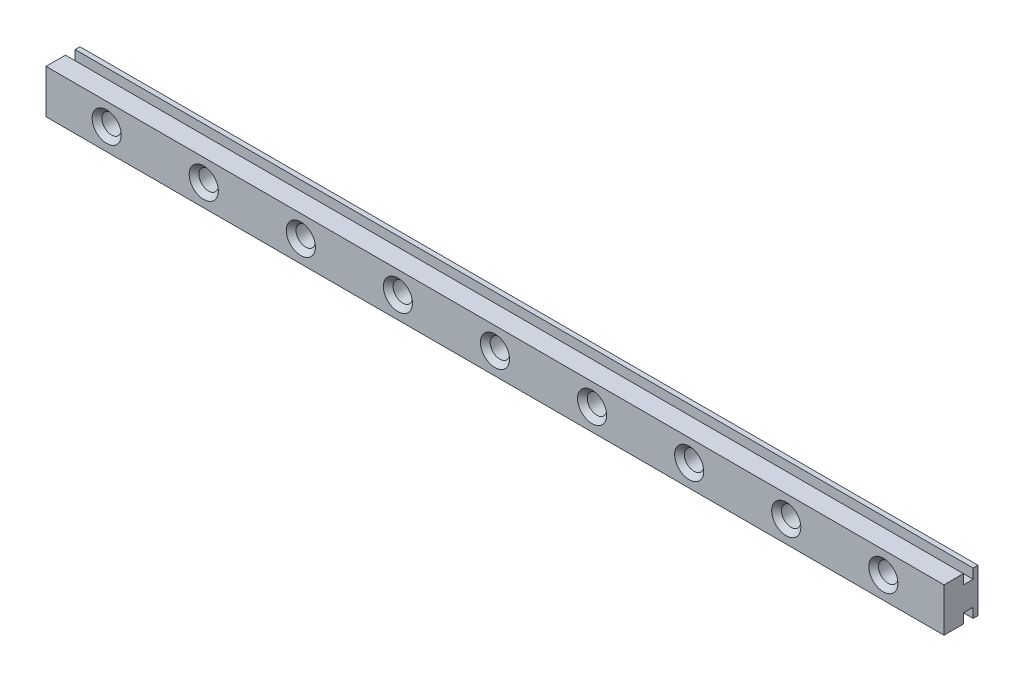
ISO-10303-21;
HEADER;
FILE_DESCRIPTION(('STEP AP214'),'2;1');
FILE_NAME('part.step','',(''),(''),'','','');
FILE_SCHEMA(('AUTOMOTIVE_DESIGN { 1 0 10303 214 1 1 1 1 }'));
ENDSEC;
DATA;
#1=APPLICATION_CONTEXT('core data for automotive mechanical design processes');
#2=APPLICATION_PROTOCOL_DEFINITION('international standard','automotive_design',2000,#1);
#3=PRODUCT_CONTEXT('',#1,'mechanical');
#4=PRODUCT('Part','Part','',(#3));
#5=PRODUCT_RELATED_PRODUCT_CATEGORY('part','',(#4));
#6=PRODUCT_DEFINITION_FORMATION('','',#4);
#7=PRODUCT_DEFINITION_CONTEXT('part definition',#1,'design');
#8=PRODUCT_DEFINITION('design','',#6,#7);
#9=PRODUCT_DEFINITION_SHAPE('','',#8);
#10=(LENGTH_UNIT() NAMED_UNIT(*) SI_UNIT(.MILLI.,.METRE.));
#11=(NAMED_UNIT(*) PLANE_ANGLE_UNIT() SI_UNIT($,.RADIAN.));
#12=(NAMED_UNIT(*) SI_UNIT($,.STERADIAN.) SOLID_ANGLE_UNIT());
#13=UNCERTAINTY_MEASURE_WITH_UNIT(LENGTH_MEASURE(1.E-05),#10,'distance_accuracy_value','');
#14=(GEOMETRIC_REPRESENTATION_CONTEXT(3) GLOBAL_UNCERTAINTY_ASSIGNED_CONTEXT((#13)) GLOBAL_UNIT_ASSIGNED_CONTEXT((#10,
#11,#12)) REPRESENTATION_CONTEXT('',''));
#15=CARTESIAN_POINT('',(0.,0.,0.));
#16=DIRECTION('',(0.,0.,1.));
#17=DIRECTION('',(1.,0.,0.));
#18=AXIS2_PLACEMENT_3D('',#15,#16,#17);
#19=CARTESIAN_POINT('',(92.5,-4.5,7.));
#20=DIRECTION('',(0.,1.,0.));
#21=DIRECTION('',(0.,0.,1.));
#22=AXIS2_PLACEMENT_3D('',#19,#20,#21);
#23=PLANE('',#22);
#24=DIRECTION('',(0.,0.,-1.));
#25=VECTOR('',#24,1.);
#26=CARTESIAN_POINT('',(-92.5,-4.5,7.));
#27=LINE('',#26,#25);
#28=CARTESIAN_POINT('',(-92.5,-4.5,7.));
#29=VERTEX_POINT('',#28);
#30=CARTESIAN_POINT('',(-92.5,-4.5,3.));
#31=VERTEX_POINT('',#30);
#32=EDGE_CURVE('E247',#29,#31,#27,.T.);
#33=ORIENTED_EDGE('',*,*,#32,.T.);
#34=DIRECTION('',(-1.,0.,0.));
#35=VECTOR('',#34,1.);
#36=CARTESIAN_POINT('',(92.501,-4.5,3.));
#37=LINE('',#36,#35);
#38=CARTESIAN_POINT('',(92.5,-4.5,3.));
#39=VERTEX_POINT('',#38);
#40=EDGE_CURVE('E175',#39,#31,#37,.T.);
#41=ORIENTED_EDGE('',*,*,#40,.F.);
#42=DIRECTION('',(0.,0.,-1.));
#43=VECTOR('',#42,1.);
#44=CARTESIAN_POINT('',(92.5,-4.5,7.));
#45=LINE('',#44,#43);
#46=CARTESIAN_POINT('',(92.5,-4.5,7.));
#47=VERTEX_POINT('',#46);
#48=EDGE_CURVE('E243',#47,#39,#45,.T.);
#49=ORIENTED_EDGE('',*,*,#48,.F.);
#50=DIRECTION('',(1.,0.,0.));
#51=VECTOR('',#50,1.);
#52=CARTESIAN_POINT('',(92.5,-4.5,7.));
#53=LINE('',#52,#51);
#54=EDGE_CURVE('E219',#29,#47,#53,.T.);
#55=ORIENTED_EDGE('',*,*,#54,.F.);
#56=EDGE_LOOP('',(#33,#41,#49,#55));
#57=FACE_BOUND('',#56,.T.);
#58=ADVANCED_FACE('F39',(#57),#23,.F.);
#59=CARTESIAN_POINT('',(92.5,4.5,7.));
#60=DIRECTION('',(0.,-1.,0.));
#61=DIRECTION('',(0.,0.,-1.));
#62=AXIS2_PLACEMENT_3D('',#59,#60,#61);
#63=PLANE('',#62);
#64=DIRECTION('',(0.,0.,-1.));
#65=VECTOR('',#64,1.);
#66=CARTESIAN_POINT('',(-92.5,4.5,7.));
#67=LINE('',#66,#65);
#68=CARTESIAN_POINT('',(-92.5,4.5,1.));
#69=VERTEX_POINT('',#68);
#70=CARTESIAN_POINT('',(-92.5,4.5,0.));
#71=VERTEX_POINT('',#70);
#72=EDGE_CURVE('E226',#69,#71,#67,.T.);
#73=ORIENTED_EDGE('',*,*,#72,.F.);
#74=DIRECTION('',(-1.,0.,0.));
#75=VECTOR('',#74,1.);
#76=CARTESIAN_POINT('',(92.501,4.5,1.));
#77=LINE('',#76,#75);
#78=CARTESIAN_POINT('',(92.5,4.5,1.));
#79=VERTEX_POINT('',#78);
#80=EDGE_CURVE('E149',#79,#69,#77,.T.);
#81=ORIENTED_EDGE('',*,*,#80,.F.);
#82=DIRECTION('',(0.,0.,-1.));
#83=VECTOR('',#82,1.);
#84=CARTESIAN_POINT('',(92.5,4.5,7.));
#85=LINE('',#84,#83);
#86=CARTESIAN_POINT('',(92.5,4.5,0.));
#87=VERTEX_POINT('',#86);
#88=EDGE_CURVE('E154',#79,#87,#85,.T.);
#89=ORIENTED_EDGE('',*,*,#88,.T.);
#90=DIRECTION('',(-1.,0.,0.));
#91=VECTOR('',#90,1.);
#92=CARTESIAN_POINT('',(92.5,4.5,0.));
#93=LINE('',#92,#91);
#94=EDGE_CURVE('E220',#87,#71,#93,.T.);
#95=ORIENTED_EDGE('',*,*,#94,.T.);
#96=EDGE_LOOP('',(#73,#81,#89,#95));
#97=FACE_BOUND('',#96,.T.);
#98=ADVANCED_FACE('F318',(#97),#63,.F.);
#99=CARTESIAN_POINT('',(0.,0.,7.));
#100=DIRECTION('',(0.,0.,1.));
#101=DIRECTION('',(1.,0.,0.));
#102=AXIS2_PLACEMENT_3D('',#99,#100,#101);
#103=PLANE('',#102);
#104=CARTESIAN_POINT('',(79.9999999999999,0.,7.));
#105=DIRECTION('',(0.,0.,1.));
#106=DIRECTION('',(1.,0.,0.));
#107=AXIS2_PLACEMENT_3D('',#104,#105,#106);
#108=CIRCLE('',#107,2.99999999999995);
#109=CARTESIAN_POINT('',(82.9999999999999,0.,7.));
#110=VERTEX_POINT('',#109);
#111=EDGE_CURVE('E277',#110,#110,#108,.F.);
#112=ORIENTED_EDGE('',*,*,#111,.T.);
#113=EDGE_LOOP('',(#112));
#114=FACE_BOUND('',#113,.T.);
#115=CARTESIAN_POINT('',(59.9999999999999,0.,7.));
#116=DIRECTION('',(0.,0.,1.));
#117=DIRECTION('',(1.,0.,0.));
#118=AXIS2_PLACEMENT_3D('',#115,#116,#117);
#119=CIRCLE('',#118,2.99999999999995);
#120=CARTESIAN_POINT('',(62.9999999999999,0.,7.));
#121=VERTEX_POINT('',#120);
#122=EDGE_CURVE('E274',#121,#121,#119,.F.);
#123=ORIENTED_EDGE('',*,*,#122,.T.);
#124=EDGE_LOOP('',(#123));
#125=FACE_BOUND('',#124,.T.);
#126=CARTESIAN_POINT('',(39.9999999999999,0.,7.));
#127=DIRECTION('',(0.,0.,1.));
#128=DIRECTION('',(1.,0.,0.));
#129=AXIS2_PLACEMENT_3D('',#126,#127,#128);
#130=CIRCLE('',#129,2.99999999999995);
#131=CARTESIAN_POINT('',(42.9999999999999,0.,7.));
#132=VERTEX_POINT('',#131);
#133=EDGE_CURVE('E271',#132,#132,#130,.F.);
#134=ORIENTED_EDGE('',*,*,#133,.T.);
#135=EDGE_LOOP('',(#134));
#136=FACE_BOUND('',#135,.T.);
#137=CARTESIAN_POINT('',(19.9999999999999,0.,7.));
#138=DIRECTION('',(0.,0.,1.));
#139=DIRECTION('',(1.,0.,0.));
#140=AXIS2_PLACEMENT_3D('',#137,#138,#139);
#141=CIRCLE('',#140,2.99999999999995);
#142=CARTESIAN_POINT('',(22.9999999999999,0.,7.));
#143=VERTEX_POINT('',#142);
#144=EDGE_CURVE('E268',#143,#143,#141,.F.);
#145=ORIENTED_EDGE('',*,*,#144,.T.);
#146=EDGE_LOOP('',(#145));
#147=FACE_BOUND('',#146,.T.);
#148=CARTESIAN_POINT('',(0.,0.,7.));
#149=DIRECTION('',(0.,0.,1.));
#150=DIRECTION('',(1.,0.,0.));
#151=AXIS2_PLACEMENT_3D('',#148,#149,#150);
#152=CIRCLE('',#151,3.00000000000003);
#153=CARTESIAN_POINT('',(2.99999999999995,0.,7.));
#154=VERTEX_POINT('',#153);
#155=EDGE_CURVE('E265',#154,#154,#152,.F.);
#156=ORIENTED_EDGE('',*,*,#155,.T.);
#157=EDGE_LOOP('',(#156));
#158=FACE_BOUND('',#157,.T.);
#159=CARTESIAN_POINT('',(-20.0000000000001,0.,7.));
#160=DIRECTION('',(0.,0.,1.));
#161=DIRECTION('',(1.,0.,0.));
#162=AXIS2_PLACEMENT_3D('',#159,#160,#161);
#163=CIRCLE('',#162,2.99999999999995);
#164=CARTESIAN_POINT('',(-17.0000000000001,0.,7.));
#165=VERTEX_POINT('',#164);
#166=EDGE_CURVE('E262',#165,#165,#163,.F.);
#167=ORIENTED_EDGE('',*,*,#166,.T.);
#168=EDGE_LOOP('',(#167));
#169=FACE_BOUND('',#168,.T.);
#170=CARTESIAN_POINT('',(-40.0000000000001,0.,7.));
#171=DIRECTION('',(0.,0.,1.));
#172=DIRECTION('',(1.,0.,0.));
#173=AXIS2_PLACEMENT_3D('',#170,#171,#172);
#174=CIRCLE('',#173,2.99999999999995);
#175=CARTESIAN_POINT('',(-37.0000000000001,0.,7.));
#176=VERTEX_POINT('',#175);
#177=EDGE_CURVE('E259',#176,#176,#174,.F.);
#178=ORIENTED_EDGE('',*,*,#177,.T.);
#179=EDGE_LOOP('',(#178));
#180=FACE_BOUND('',#179,.T.);
#181=CARTESIAN_POINT('',(-60.0000000000001,0.,7.));
#182=DIRECTION('',(0.,0.,1.));
#183=DIRECTION('',(1.,0.,0.));
#184=AXIS2_PLACEMENT_3D('',#181,#182,#183);
#185=CIRCLE('',#184,3.00000000000003);
#186=CARTESIAN_POINT('',(-57.,0.,7.));
#187=VERTEX_POINT('',#186);
#188=EDGE_CURVE('E256',#187,#187,#185,.F.);
#189=ORIENTED_EDGE('',*,*,#188,.T.);
#190=EDGE_LOOP('',(#189));
#191=FACE_BOUND('',#190,.T.);
#192=CARTESIAN_POINT('',(-80.0000000000001,0.,7.));
#193=DIRECTION('',(0.,0.,1.));
#194=DIRECTION('',(1.,0.,0.));
#195=AXIS2_PLACEMENT_3D('',#192,#193,#194);
#196=CIRCLE('',#195,3.00000000000003);
#197=CARTESIAN_POINT('',(-77.0000000000001,0.,7.));
#198=VERTEX_POINT('',#197);
#199=EDGE_CURVE('E253',#198,#198,#196,.F.);
#200=ORIENTED_EDGE('',*,*,#199,.T.);
#201=EDGE_LOOP('',(#200));
#202=FACE_BOUND('',#201,.T.);
#203=DIRECTION('',(0.,-1.,0.));
#204=VECTOR('',#203,1.);
#205=CARTESIAN_POINT('',(-92.5,-4.5,7.));
#206=LINE('',#205,#204);
#207=CARTESIAN_POINT('',(-92.5,4.5,7.));
#208=VERTEX_POINT('',#207);
#209=EDGE_CURVE('E216',#208,#29,#206,.T.);
#210=ORIENTED_EDGE('',*,*,#209,.T.);
#211=ORIENTED_EDGE('',*,*,#54,.T.);
#212=DIRECTION('',(0.,1.,0.));
#213=VECTOR('',#212,1.);
#214=CARTESIAN_POINT('',(92.5,-4.5,7.));
#215=LINE('',#214,#213);
#216=CARTESIAN_POINT('',(92.5,4.5,7.));
#217=VERTEX_POINT('',#216);
#218=EDGE_CURVE('E222',#47,#217,#215,.T.);
#219=ORIENTED_EDGE('',*,*,#218,.T.);
#220=DIRECTION('',(-1.,0.,0.));
#221=VECTOR('',#220,1.);
#222=CARTESIAN_POINT('',(92.5,4.5,7.));
#223=LINE('',#222,#221);
#224=EDGE_CURVE('E224',#217,#208,#223,.T.);
#225=ORIENTED_EDGE('',*,*,#224,.T.);
#226=EDGE_LOOP('',(#210,#211,#219,#225));
#227=FACE_BOUND('',#226,.T.);
#228=ADVANCED_FACE('F325',(#114,#125,#136,#147,#158,#169,#180,#191,#202,#227),#103,.T.);
#229=CARTESIAN_POINT('',(0.,0.,0.));
#230=DIRECTION('',(0.,0.,1.));
#231=DIRECTION('',(1.,0.,0.));
#232=AXIS2_PLACEMENT_3D('',#229,#230,#231);
#233=PLANE('',#232);
#234=DIRECTION('',(0.,-1.,0.));
#235=VECTOR('',#234,1.);
#236=CARTESIAN_POINT('',(-92.5,-4.5,0.));
#237=LINE('',#236,#235);
#238=CARTESIAN_POINT('',(-92.5,-4.5,0.));
#239=VERTEX_POINT('',#238);
#240=EDGE_CURVE('E215',#71,#239,#237,.T.);
#241=ORIENTED_EDGE('',*,*,#240,.F.);
#242=ORIENTED_EDGE('',*,*,#94,.F.);
#243=DIRECTION('',(0.,1.,0.));
#244=VECTOR('',#243,1.);
#245=CARTESIAN_POINT('',(92.5,-4.5,0.));
#246=LINE('',#245,#244);
#247=CARTESIAN_POINT('',(92.5,-4.5,0.));
#248=VERTEX_POINT('',#247);
#249=EDGE_CURVE('E232',#248,#87,#246,.T.);
#250=ORIENTED_EDGE('',*,*,#249,.F.);
#251=DIRECTION('',(1.,0.,0.));
#252=VECTOR('',#251,1.);
#253=CARTESIAN_POINT('',(92.5,-4.5,0.));
#254=LINE('',#253,#252);
#255=EDGE_CURVE('E229',#239,#248,#254,.T.);
#256=ORIENTED_EDGE('',*,*,#255,.F.);
#257=EDGE_LOOP('',(#241,#242,#250,#256));
#258=FACE_BOUND('',#257,.T.);
#259=CARTESIAN_POINT('',(-80.0000000000001,0.,0.));
#260=DIRECTION('',(0.,0.,1.));
#261=DIRECTION('',(1.,0.,0.));
#262=AXIS2_PLACEMENT_3D('',#259,#260,#261);
#263=CIRCLE('',#262,2.);
#264=CARTESIAN_POINT('',(-78.0000000000001,0.,0.));
#265=VERTEX_POINT('',#264);
#266=EDGE_CURVE('E212',#265,#265,#263,.T.);
#267=ORIENTED_EDGE('',*,*,#266,.T.);
#268=EDGE_LOOP('',(#267));
#269=FACE_BOUND('',#268,.T.);
#270=CARTESIAN_POINT('',(-60.0000000000001,0.,0.));
#271=DIRECTION('',(0.,0.,1.));
#272=DIRECTION('',(1.,0.,0.));
#273=AXIS2_PLACEMENT_3D('',#270,#271,#272);
#274=CIRCLE('',#273,2.);
#275=CARTESIAN_POINT('',(-58.0000000000001,0.,0.));
#276=VERTEX_POINT('',#275);
#277=EDGE_CURVE('E209',#276,#276,#274,.T.);
#278=ORIENTED_EDGE('',*,*,#277,.T.);
#279=EDGE_LOOP('',(#278));
#280=FACE_BOUND('',#279,.T.);
#281=CARTESIAN_POINT('',(-40.0000000000001,0.,0.));
#282=DIRECTION('',(0.,0.,1.));
#283=DIRECTION('',(1.,0.,0.));
#284=AXIS2_PLACEMENT_3D('',#281,#282,#283);
#285=CIRCLE('',#284,2.);
#286=CARTESIAN_POINT('',(-38.0000000000001,0.,0.));
#287=VERTEX_POINT('',#286);
#288=EDGE_CURVE('E206',#287,#287,#285,.T.);
#289=ORIENTED_EDGE('',*,*,#288,.T.);
#290=EDGE_LOOP('',(#289));
#291=FACE_BOUND('',#290,.T.);
#292=CARTESIAN_POINT('',(-20.0000000000001,0.,0.));
#293=DIRECTION('',(0.,0.,1.));
#294=DIRECTION('',(1.,0.,0.));
#295=AXIS2_PLACEMENT_3D('',#292,#293,#294);
#296=CIRCLE('',#295,2.);
#297=CARTESIAN_POINT('',(-18.0000000000001,0.,0.));
#298=VERTEX_POINT('',#297);
#299=EDGE_CURVE('E203',#298,#298,#296,.T.);
#300=ORIENTED_EDGE('',*,*,#299,.T.);
#301=EDGE_LOOP('',(#300));
#302=FACE_BOUND('',#301,.T.);
#303=CARTESIAN_POINT('',(0.,0.,0.));
#304=DIRECTION('',(0.,0.,1.));
#305=DIRECTION('',(1.,0.,0.));
#306=AXIS2_PLACEMENT_3D('',#303,#304,#305);
#307=CIRCLE('',#306,2.);
#308=CARTESIAN_POINT('',(1.99999999999991,0.,0.));
#309=VERTEX_POINT('',#308);
#310=EDGE_CURVE('E200',#309,#309,#307,.T.);
#311=ORIENTED_EDGE('',*,*,#310,.T.);
#312=EDGE_LOOP('',(#311));
#313=FACE_BOUND('',#312,.T.);
#314=CARTESIAN_POINT('',(19.9999999999999,0.,0.));
#315=DIRECTION('',(0.,0.,1.));
#316=DIRECTION('',(1.,0.,0.));
#317=AXIS2_PLACEMENT_3D('',#314,#315,#316);
#318=CIRCLE('',#317,2.);
#319=CARTESIAN_POINT('',(21.9999999999999,0.,0.));
#320=VERTEX_POINT('',#319);
#321=EDGE_CURVE('E197',#320,#320,#318,.T.);
#322=ORIENTED_EDGE('',*,*,#321,.T.);
#323=EDGE_LOOP('',(#322));
#324=FACE_BOUND('',#323,.T.);
#325=CARTESIAN_POINT('',(39.9999999999999,0.,0.));
#326=DIRECTION('',(0.,0.,1.));
#327=DIRECTION('',(1.,0.,0.));
#328=AXIS2_PLACEMENT_3D('',#325,#326,#327);
#329=CIRCLE('',#328,2.);
#330=CARTESIAN_POINT('',(41.9999999999999,0.,0.));
#331=VERTEX_POINT('',#330);
#332=EDGE_CURVE('E194',#331,#331,#329,.T.);
#333=ORIENTED_EDGE('',*,*,#332,.T.);
#334=EDGE_LOOP('',(#333));
#335=FACE_BOUND('',#334,.T.);
#336=CARTESIAN_POINT('',(59.9999999999999,0.,0.));
#337=DIRECTION('',(0.,0.,1.));
#338=DIRECTION('',(1.,0.,0.));
#339=AXIS2_PLACEMENT_3D('',#336,#337,#338);
#340=CIRCLE('',#339,2.);
#341=CARTESIAN_POINT('',(61.9999999999999,0.,0.));
#342=VERTEX_POINT('',#341);
#343=EDGE_CURVE('E191',#342,#342,#340,.T.);
#344=ORIENTED_EDGE('',*,*,#343,.T.);
#345=EDGE_LOOP('',(#344));
#346=FACE_BOUND('',#345,.T.);
#347=CARTESIAN_POINT('',(79.9999999999999,0.,0.));
#348=DIRECTION('',(0.,0.,1.));
#349=DIRECTION('',(1.,0.,0.));
#350=AXIS2_PLACEMENT_3D('',#347,#348,#349);
#351=CIRCLE('',#350,1.99999999999998);
#352=CARTESIAN_POINT('',(81.9999999999999,0.,0.));
#353=VERTEX_POINT('',#352);
#354=EDGE_CURVE('E148',#353,#353,#351,.T.);
#355=ORIENTED_EDGE('',*,*,#354,.T.);
#356=EDGE_LOOP('',(#355));
#357=FACE_BOUND('',#356,.T.);
#358=ADVANCED_FACE('F338',(#258,#269,#280,#291,#302,#313,#324,#335,#346,#357),#233,.F.);
#359=CARTESIAN_POINT('',(-92.5,-4.5,7.));
#360=DIRECTION('',(1.,0.,0.));
#361=DIRECTION('',(0.,0.,-1.));
#362=AXIS2_PLACEMENT_3D('',#359,#360,#361);
#363=PLANE('',#362);
#364=DIRECTION('',(0.,0.,1.));
#365=VECTOR('',#364,1.);
#366=CARTESIAN_POINT('',(-92.5,2.49999999999998,3.));
#367=LINE('',#366,#365);
#368=CARTESIAN_POINT('',(-92.5,2.49999999999998,1.));
#369=VERTEX_POINT('',#368);
#370=CARTESIAN_POINT('',(-92.5,2.49999999999998,3.));
#371=VERTEX_POINT('',#370);
#372=EDGE_CURVE('E157',#369,#371,#367,.T.);
#373=ORIENTED_EDGE('',*,*,#372,.F.);
#374=DIRECTION('',(0.,-1.,0.));
#375=VECTOR('',#374,1.);
#376=CARTESIAN_POINT('',(-92.5,2.49999999999998,1.));
#377=LINE('',#376,#375);
#378=EDGE_CURVE('E136',#69,#369,#377,.T.);
#379=ORIENTED_EDGE('',*,*,#378,.F.);
#380=ORIENTED_EDGE('',*,*,#72,.T.);
#381=ORIENTED_EDGE('',*,*,#240,.T.);
#382=CARTESIAN_POINT('',(-92.5,-4.5,1.));
#383=VERTEX_POINT('',#382);
#384=EDGE_CURVE('E246',#383,#239,#27,.T.);
#385=ORIENTED_EDGE('',*,*,#384,.F.);
#386=DIRECTION('',(0.,-1.,0.));
#387=VECTOR('',#386,1.);
#388=CARTESIAN_POINT('',(-92.5,-2.49999999999998,1.));
#389=LINE('',#388,#387);
#390=CARTESIAN_POINT('',(-92.5,-2.49999999999998,1.));
#391=VERTEX_POINT('',#390);
#392=EDGE_CURVE('E180',#391,#383,#389,.T.);
#393=ORIENTED_EDGE('',*,*,#392,.F.);
#394=DIRECTION('',(0.,0.,-1.));
#395=VECTOR('',#394,1.);
#396=CARTESIAN_POINT('',(-92.5,-2.49999999999998,3.));
#397=LINE('',#396,#395);
#398=CARTESIAN_POINT('',(-92.5,-2.49999999999998,3.));
#399=VERTEX_POINT('',#398);
#400=EDGE_CURVE('E182',#399,#391,#397,.T.);
#401=ORIENTED_EDGE('',*,*,#400,.F.);
#402=DIRECTION('',(0.,1.,0.));
#403=VECTOR('',#402,1.);
#404=CARTESIAN_POINT('',(-92.5,-2.49999999999998,3.));
#405=LINE('',#404,#403);
#406=EDGE_CURVE('E173',#31,#399,#405,.T.);
#407=ORIENTED_EDGE('',*,*,#406,.F.);
#408=ORIENTED_EDGE('',*,*,#32,.F.);
#409=ORIENTED_EDGE('',*,*,#209,.F.);
#410=CARTESIAN_POINT('',(-92.5,4.5,3.));
#411=VERTEX_POINT('',#410);
#412=EDGE_CURVE('E236',#208,#411,#67,.T.);
#413=ORIENTED_EDGE('',*,*,#412,.T.);
#414=DIRECTION('',(0.,1.,0.));
#415=VECTOR('',#414,1.);
#416=CARTESIAN_POINT('',(-92.5,2.49999999999998,3.));
#417=LINE('',#416,#415);
#418=EDGE_CURVE('E63',#371,#411,#417,.T.);
#419=ORIENTED_EDGE('',*,*,#418,.F.);
#420=EDGE_LOOP('',(#373,#379,#380,#381,#385,#393,#401,#407,#408,#409,#413,#419));
#421=FACE_BOUND('',#420,.T.);
#422=ADVANCED_FACE('F332',(#421),#363,.F.);
#423=CARTESIAN_POINT('',(92.5,-4.5,1.));
#424=VERTEX_POINT('',#423);
#425=EDGE_CURVE('E242',#424,#248,#45,.T.);
#426=ORIENTED_EDGE('',*,*,#425,.F.);
#427=DIRECTION('',(-1.,0.,0.));
#428=VECTOR('',#427,1.);
#429=CARTESIAN_POINT('',(92.501,-4.5,1.));
#430=LINE('',#429,#428);
#431=EDGE_CURVE('E55',#424,#383,#430,.T.);
#432=ORIENTED_EDGE('',*,*,#431,.T.);
#433=ORIENTED_EDGE('',*,*,#384,.T.);
#434=ORIENTED_EDGE('',*,*,#255,.T.);
#435=EDGE_LOOP('',(#426,#432,#433,#434));
#436=FACE_BOUND('',#435,.T.);
#437=ADVANCED_FACE('F321',(#436),#23,.F.);
#438=CARTESIAN_POINT('',(92.5,-4.5,7.));
#439=DIRECTION('',(-1.,0.,0.));
#440=DIRECTION('',(0.,0.,1.));
#441=AXIS2_PLACEMENT_3D('',#438,#439,#440);
#442=PLANE('',#441);
#443=ORIENTED_EDGE('',*,*,#88,.F.);
#444=DIRECTION('',(0.,1.,0.));
#445=VECTOR('',#444,1.);
#446=CARTESIAN_POINT('',(92.5,2.49999999999998,1.));
#447=LINE('',#446,#445);
#448=CARTESIAN_POINT('',(92.5,2.49999999999998,1.));
#449=VERTEX_POINT('',#448);
#450=EDGE_CURVE('E133',#449,#79,#447,.T.);
#451=ORIENTED_EDGE('',*,*,#450,.F.);
#452=DIRECTION('',(0.,0.,-1.));
#453=VECTOR('',#452,1.);
#454=CARTESIAN_POINT('',(92.5,2.49999999999998,3.));
#455=LINE('',#454,#453);
#456=CARTESIAN_POINT('',(92.5,2.49999999999998,3.));
#457=VERTEX_POINT('',#456);
#458=EDGE_CURVE('E143',#457,#449,#455,.T.);
#459=ORIENTED_EDGE('',*,*,#458,.F.);
#460=DIRECTION('',(0.,-1.,0.));
#461=VECTOR('',#460,1.);
#462=CARTESIAN_POINT('',(92.5,2.49999999999998,3.));
#463=LINE('',#462,#461);
#464=CARTESIAN_POINT('',(92.5,4.5,3.));
#465=VERTEX_POINT('',#464);
#466=EDGE_CURVE('E155',#465,#457,#463,.T.);
#467=ORIENTED_EDGE('',*,*,#466,.F.);
#468=EDGE_CURVE('E239',#217,#465,#85,.T.);
#469=ORIENTED_EDGE('',*,*,#468,.F.);
#470=ORIENTED_EDGE('',*,*,#218,.F.);
#471=ORIENTED_EDGE('',*,*,#48,.T.);
#472=DIRECTION('',(0.,-1.,0.));
#473=VECTOR('',#472,1.);
#474=CARTESIAN_POINT('',(92.5,-2.49999999999998,3.));
#475=LINE('',#474,#473);
#476=CARTESIAN_POINT('',(92.5,-2.49999999999998,3.));
#477=VERTEX_POINT('',#476);
#478=EDGE_CURVE('E185',#477,#39,#475,.T.);
#479=ORIENTED_EDGE('',*,*,#478,.F.);
#480=DIRECTION('',(0.,0.,1.));
#481=VECTOR('',#480,1.);
#482=CARTESIAN_POINT('',(92.5,-2.49999999999998,3.));
#483=LINE('',#482,#481);
#484=CARTESIAN_POINT('',(92.5,-2.49999999999998,1.));
#485=VERTEX_POINT('',#484);
#486=EDGE_CURVE('E159',#485,#477,#483,.T.);
#487=ORIENTED_EDGE('',*,*,#486,.F.);
#488=DIRECTION('',(0.,1.,0.));
#489=VECTOR('',#488,1.);
#490=CARTESIAN_POINT('',(92.5,-2.49999999999998,1.));
#491=LINE('',#490,#489);
#492=EDGE_CURVE('E168',#424,#485,#491,.T.);
#493=ORIENTED_EDGE('',*,*,#492,.F.);
#494=ORIENTED_EDGE('',*,*,#425,.T.);
#495=ORIENTED_EDGE('',*,*,#249,.T.);
#496=EDGE_LOOP('',(#443,#451,#459,#467,#469,#470,#471,#479,#487,#493,#494,#495));
#497=FACE_BOUND('',#496,.T.);
#498=ADVANCED_FACE('F152',(#497),#442,.F.);
#499=ORIENTED_EDGE('',*,*,#468,.T.);
#500=DIRECTION('',(-1.,0.,0.));
#501=VECTOR('',#500,1.);
#502=CARTESIAN_POINT('',(92.501,4.5,3.));
#503=LINE('',#502,#501);
#504=EDGE_CURVE('E165',#465,#411,#503,.T.);
#505=ORIENTED_EDGE('',*,*,#504,.T.);
#506=ORIENTED_EDGE('',*,*,#412,.F.);
#507=ORIENTED_EDGE('',*,*,#224,.F.);
#508=EDGE_LOOP('',(#499,#505,#506,#507));
#509=FACE_BOUND('',#508,.T.);
#510=ADVANCED_FACE('F328',(#509),#63,.F.);
#511=CARTESIAN_POINT('',(-80.0000000000001,0.,7.));
#512=DIRECTION('',(0.,0.,-1.));
#513=DIRECTION('',(-1.,0.,0.));
#514=AXIS2_PLACEMENT_3D('',#511,#512,#513);
#515=CYLINDRICAL_SURFACE('',#514,2.);
#516=CARTESIAN_POINT('',(-80.0000000000001,0.,5.99999999999996));
#517=DIRECTION('',(0.,0.,1.));
#518=DIRECTION('',(1.,0.,0.));
#519=AXIS2_PLACEMENT_3D('',#516,#517,#518);
#520=CIRCLE('',#519,2.);
#521=CARTESIAN_POINT('',(-78.0000000000001,0.,5.99999999999996));
#522=VERTEX_POINT('',#521);
#523=EDGE_CURVE('E11',#522,#522,#520,.T.);
#524=ORIENTED_EDGE('',*,*,#523,.T.);
#525=EDGE_LOOP('',(#524));
#526=FACE_BOUND('',#525,.T.);
#527=ORIENTED_EDGE('',*,*,#266,.F.);
#528=EDGE_LOOP('',(#527));
#529=FACE_BOUND('',#528,.T.);
#530=ADVANCED_FACE('F410',(#526,#529),#515,.F.);
#531=CARTESIAN_POINT('',(-60.0000000000001,0.,7.));
#532=DIRECTION('',(0.,0.,-1.));
#533=DIRECTION('',(-1.,0.,0.));
#534=AXIS2_PLACEMENT_3D('',#531,#532,#533);
#535=CYLINDRICAL_SURFACE('',#534,2.);
#536=CARTESIAN_POINT('',(-60.0000000000001,0.,5.99999999999996));
#537=DIRECTION('',(0.,0.,1.));
#538=DIRECTION('',(1.,0.,0.));
#539=AXIS2_PLACEMENT_3D('',#536,#537,#538);
#540=CIRCLE('',#539,2.);
#541=CARTESIAN_POINT('',(-58.0000000000001,0.,5.99999999999996));
#542=VERTEX_POINT('',#541);
#543=EDGE_CURVE('E48',#542,#542,#540,.T.);
#544=ORIENTED_EDGE('',*,*,#543,.T.);
#545=EDGE_LOOP('',(#544));
#546=FACE_BOUND('',#545,.T.);
#547=ORIENTED_EDGE('',*,*,#277,.F.);
#548=EDGE_LOOP('',(#547));
#549=FACE_BOUND('',#548,.T.);
#550=ADVANCED_FACE('F300',(#546,#549),#535,.F.);
#551=CARTESIAN_POINT('',(-40.0000000000001,0.,7.));
#552=DIRECTION('',(0.,0.,-1.));
#553=DIRECTION('',(-1.,0.,0.));
#554=AXIS2_PLACEMENT_3D('',#551,#552,#553);
#555=CYLINDRICAL_SURFACE('',#554,2.);
#556=CARTESIAN_POINT('',(-40.0000000000001,0.,6.00000000000004));
#557=DIRECTION('',(0.,0.,1.));
#558=DIRECTION('',(1.,0.,0.));
#559=AXIS2_PLACEMENT_3D('',#556,#557,#558);
#560=CIRCLE('',#559,2.);
#561=CARTESIAN_POINT('',(-38.0000000000001,0.,6.00000000000004));
#562=VERTEX_POINT('',#561);
#563=EDGE_CURVE('E295',#562,#562,#560,.T.);
#564=ORIENTED_EDGE('',*,*,#563,.T.);
#565=EDGE_LOOP('',(#564));
#566=FACE_BOUND('',#565,.T.);
#567=ORIENTED_EDGE('',*,*,#288,.F.);
#568=EDGE_LOOP('',(#567));
#569=FACE_BOUND('',#568,.T.);
#570=ADVANCED_FACE('F403',(#566,#569),#555,.F.);
#571=CARTESIAN_POINT('',(-20.0000000000001,0.,7.));
#572=DIRECTION('',(0.,0.,-1.));
#573=DIRECTION('',(-1.,0.,0.));
#574=AXIS2_PLACEMENT_3D('',#571,#572,#573);
#575=CYLINDRICAL_SURFACE('',#574,2.);
#576=CARTESIAN_POINT('',(-20.0000000000001,0.,6.00000000000004));
#577=DIRECTION('',(0.,0.,1.));
#578=DIRECTION('',(1.,0.,0.));
#579=AXIS2_PLACEMENT_3D('',#576,#577,#578);
#580=CIRCLE('',#579,2.);
#581=CARTESIAN_POINT('',(-18.0000000000001,0.,6.00000000000004));
#582=VERTEX_POINT('',#581);
#583=EDGE_CURVE('E292',#582,#582,#580,.T.);
#584=ORIENTED_EDGE('',*,*,#583,.T.);
#585=EDGE_LOOP('',(#584));
#586=FACE_BOUND('',#585,.T.);
#587=ORIENTED_EDGE('',*,*,#299,.F.);
#588=EDGE_LOOP('',(#587));
#589=FACE_BOUND('',#588,.T.);
#590=ADVANCED_FACE('F399',(#586,#589),#575,.F.);
#591=CARTESIAN_POINT('',(0.,0.,7.));
#592=DIRECTION('',(0.,0.,-1.));
#593=DIRECTION('',(-1.,0.,0.));
#594=AXIS2_PLACEMENT_3D('',#591,#592,#593);
#595=CYLINDRICAL_SURFACE('',#594,2.);
#596=CARTESIAN_POINT('',(0.,0.,5.99999999999996));
#597=DIRECTION('',(0.,0.,1.));
#598=DIRECTION('',(1.,0.,0.));
#599=AXIS2_PLACEMENT_3D('',#596,#597,#598);
#600=CIRCLE('',#599,2.);
#601=CARTESIAN_POINT('',(1.99999999999991,0.,5.99999999999996));
#602=VERTEX_POINT('',#601);
#603=EDGE_CURVE('E289',#602,#602,#600,.T.);
#604=ORIENTED_EDGE('',*,*,#603,.T.);
#605=EDGE_LOOP('',(#604));
#606=FACE_BOUND('',#605,.T.);
#607=ORIENTED_EDGE('',*,*,#310,.F.);
#608=EDGE_LOOP('',(#607));
#609=FACE_BOUND('',#608,.T.);
#610=ADVANCED_FACE('F395',(#606,#609),#595,.F.);
#611=CARTESIAN_POINT('',(19.9999999999999,0.,7.));
#612=DIRECTION('',(0.,0.,-1.));
#613=DIRECTION('',(-1.,0.,0.));
#614=AXIS2_PLACEMENT_3D('',#611,#612,#613);
#615=CYLINDRICAL_SURFACE('',#614,2.);
#616=CARTESIAN_POINT('',(19.9999999999999,0.,6.00000000000004));
#617=DIRECTION('',(0.,0.,1.));
#618=DIRECTION('',(1.,0.,0.));
#619=AXIS2_PLACEMENT_3D('',#616,#617,#618);
#620=CIRCLE('',#619,2.);
#621=CARTESIAN_POINT('',(21.9999999999999,0.,6.00000000000004));
#622=VERTEX_POINT('',#621);
#623=EDGE_CURVE('E286',#622,#622,#620,.T.);
#624=ORIENTED_EDGE('',*,*,#623,.T.);
#625=EDGE_LOOP('',(#624));
#626=FACE_BOUND('',#625,.T.);
#627=ORIENTED_EDGE('',*,*,#321,.F.);
#628=EDGE_LOOP('',(#627));
#629=FACE_BOUND('',#628,.T.);
#630=ADVANCED_FACE('F391',(#626,#629),#615,.F.);
#631=CARTESIAN_POINT('',(39.9999999999999,0.,7.));
#632=DIRECTION('',(0.,0.,-1.));
#633=DIRECTION('',(-1.,0.,0.));
#634=AXIS2_PLACEMENT_3D('',#631,#632,#633);
#635=CYLINDRICAL_SURFACE('',#634,2.);
#636=CARTESIAN_POINT('',(39.9999999999999,0.,6.00000000000004));
#637=DIRECTION('',(0.,0.,1.));
#638=DIRECTION('',(1.,0.,0.));
#639=AXIS2_PLACEMENT_3D('',#636,#637,#638);
#640=CIRCLE('',#639,2.);
#641=CARTESIAN_POINT('',(41.9999999999999,0.,6.00000000000004));
#642=VERTEX_POINT('',#641);
#643=EDGE_CURVE('E283',#642,#642,#640,.T.);
#644=ORIENTED_EDGE('',*,*,#643,.T.);
#645=EDGE_LOOP('',(#644));
#646=FACE_BOUND('',#645,.T.);
#647=ORIENTED_EDGE('',*,*,#332,.F.);
#648=EDGE_LOOP('',(#647));
#649=FACE_BOUND('',#648,.T.);
#650=ADVANCED_FACE('F387',(#646,#649),#635,.F.);
#651=CARTESIAN_POINT('',(59.9999999999999,0.,7.));
#652=DIRECTION('',(0.,0.,-1.));
#653=DIRECTION('',(-1.,0.,0.));
#654=AXIS2_PLACEMENT_3D('',#651,#652,#653);
#655=CYLINDRICAL_SURFACE('',#654,2.);
#656=CARTESIAN_POINT('',(59.9999999999999,0.,6.00000000000004));
#657=DIRECTION('',(0.,0.,1.));
#658=DIRECTION('',(1.,0.,0.));
#659=AXIS2_PLACEMENT_3D('',#656,#657,#658);
#660=CIRCLE('',#659,2.);
#661=CARTESIAN_POINT('',(61.9999999999999,0.,6.00000000000004));
#662=VERTEX_POINT('',#661);
#663=EDGE_CURVE('E280',#662,#662,#660,.T.);
#664=ORIENTED_EDGE('',*,*,#663,.T.);
#665=EDGE_LOOP('',(#664));
#666=FACE_BOUND('',#665,.T.);
#667=ORIENTED_EDGE('',*,*,#343,.F.);
#668=EDGE_LOOP('',(#667));
#669=FACE_BOUND('',#668,.T.);
#670=ADVANCED_FACE('F383',(#666,#669),#655,.F.);
#671=CARTESIAN_POINT('',(79.9999999999999,0.,7.));
#672=DIRECTION('',(0.,0.,-1.));
#673=DIRECTION('',(-1.,0.,0.));
#674=AXIS2_PLACEMENT_3D('',#671,#672,#673);
#675=CYLINDRICAL_SURFACE('',#674,1.99999999999998);
#676=CARTESIAN_POINT('',(79.9999999999999,0.,6.00000000000003));
#677=DIRECTION('',(0.,0.,1.));
#678=DIRECTION('',(1.,0.,0.));
#679=AXIS2_PLACEMENT_3D('',#676,#677,#678);
#680=CIRCLE('',#679,1.99999999999998);
#681=CARTESIAN_POINT('',(81.9999999999999,0.,6.00000000000003));
#682=VERTEX_POINT('',#681);
#683=EDGE_CURVE('E250',#682,#682,#680,.T.);
#684=ORIENTED_EDGE('',*,*,#683,.T.);
#685=EDGE_LOOP('',(#684));
#686=FACE_BOUND('',#685,.T.);
#687=ORIENTED_EDGE('',*,*,#354,.F.);
#688=EDGE_LOOP('',(#687));
#689=FACE_BOUND('',#688,.T.);
#690=ADVANCED_FACE('F380',(#686,#689),#675,.F.);
#691=CARTESIAN_POINT('',(92.501,2.49999999999998,1.));
#692=DIRECTION('',(0.,0.,-1.));
#693=DIRECTION('',(-1.,0.,0.));
#694=AXIS2_PLACEMENT_3D('',#691,#692,#693);
#695=PLANE('',#694);
#696=ORIENTED_EDGE('',*,*,#450,.T.);
#697=ORIENTED_EDGE('',*,*,#80,.T.);
#698=ORIENTED_EDGE('',*,*,#378,.T.);
#699=DIRECTION('',(-1.,0.,0.));
#700=VECTOR('',#699,1.);
#701=CARTESIAN_POINT('',(92.501,2.49999999999998,1.));
#702=LINE('',#701,#700);
#703=EDGE_CURVE('E129',#449,#369,#702,.T.);
#704=ORIENTED_EDGE('',*,*,#703,.F.);
#705=EDGE_LOOP('',(#696,#697,#698,#704));
#706=FACE_BOUND('',#705,.T.);
#707=ADVANCED_FACE('F131',(#706),#695,.F.);
#708=CARTESIAN_POINT('',(92.501,2.49999999999998,3.));
#709=DIRECTION('',(0.,0.,1.));
#710=DIRECTION('',(1.,0.,0.));
#711=AXIS2_PLACEMENT_3D('',#708,#709,#710);
#712=PLANE('',#711);
#713=ORIENTED_EDGE('',*,*,#466,.T.);
#714=DIRECTION('',(-1.,0.,0.));
#715=VECTOR('',#714,1.);
#716=CARTESIAN_POINT('',(92.501,2.49999999999998,3.));
#717=LINE('',#716,#715);
#718=EDGE_CURVE('E140',#457,#371,#717,.T.);
#719=ORIENTED_EDGE('',*,*,#718,.T.);
#720=ORIENTED_EDGE('',*,*,#418,.T.);
#721=ORIENTED_EDGE('',*,*,#504,.F.);
#722=EDGE_LOOP('',(#713,#719,#720,#721));
#723=FACE_BOUND('',#722,.T.);
#724=ADVANCED_FACE('F363',(#723),#712,.F.);
#725=CARTESIAN_POINT('',(92.501,2.49999999999998,3.));
#726=DIRECTION('',(0.,-1.,0.));
#727=DIRECTION('',(0.,0.,-1.));
#728=AXIS2_PLACEMENT_3D('',#725,#726,#727);
#729=PLANE('',#728);
#730=ORIENTED_EDGE('',*,*,#458,.T.);
#731=ORIENTED_EDGE('',*,*,#703,.T.);
#732=ORIENTED_EDGE('',*,*,#372,.T.);
#733=ORIENTED_EDGE('',*,*,#718,.F.);
#734=EDGE_LOOP('',(#730,#731,#732,#733));
#735=FACE_BOUND('',#734,.T.);
#736=ADVANCED_FACE('F144',(#735),#729,.F.);
#737=CARTESIAN_POINT('',(92.501,-2.49999999999998,3.));
#738=DIRECTION('',(0.,1.,0.));
#739=DIRECTION('',(0.,0.,1.));
#740=AXIS2_PLACEMENT_3D('',#737,#738,#739);
#741=PLANE('',#740);
#742=ORIENTED_EDGE('',*,*,#486,.T.);
#743=DIRECTION('',(-1.,0.,0.));
#744=VECTOR('',#743,1.);
#745=CARTESIAN_POINT('',(92.501,-2.49999999999998,3.));
#746=LINE('',#745,#744);
#747=EDGE_CURVE('E170',#477,#399,#746,.T.);
#748=ORIENTED_EDGE('',*,*,#747,.T.);
#749=ORIENTED_EDGE('',*,*,#400,.T.);
#750=DIRECTION('',(-1.,0.,0.));
#751=VECTOR('',#750,1.);
#752=CARTESIAN_POINT('',(92.501,-2.49999999999998,1.));
#753=LINE('',#752,#751);
#754=EDGE_CURVE('E171',#485,#391,#753,.T.);
#755=ORIENTED_EDGE('',*,*,#754,.F.);
#756=EDGE_LOOP('',(#742,#748,#749,#755));
#757=FACE_BOUND('',#756,.T.);
#758=ADVANCED_FACE('F351',(#757),#741,.F.);
#759=CARTESIAN_POINT('',(92.501,-2.49999999999998,3.));
#760=DIRECTION('',(0.,0.,1.));
#761=DIRECTION('',(1.,0.,0.));
#762=AXIS2_PLACEMENT_3D('',#759,#760,#761);
#763=PLANE('',#762);
#764=ORIENTED_EDGE('',*,*,#478,.T.);
#765=ORIENTED_EDGE('',*,*,#40,.T.);
#766=ORIENTED_EDGE('',*,*,#406,.T.);
#767=ORIENTED_EDGE('',*,*,#747,.F.);
#768=EDGE_LOOP('',(#764,#765,#766,#767));
#769=FACE_BOUND('',#768,.T.);
#770=ADVANCED_FACE('F369',(#769),#763,.F.);
#771=CARTESIAN_POINT('',(92.501,-2.49999999999998,1.));
#772=DIRECTION('',(0.,0.,-1.));
#773=DIRECTION('',(-1.,0.,0.));
#774=AXIS2_PLACEMENT_3D('',#771,#772,#773);
#775=PLANE('',#774);
#776=ORIENTED_EDGE('',*,*,#492,.T.);
#777=ORIENTED_EDGE('',*,*,#754,.T.);
#778=ORIENTED_EDGE('',*,*,#392,.T.);
#779=ORIENTED_EDGE('',*,*,#431,.F.);
#780=EDGE_LOOP('',(#776,#777,#778,#779));
#781=FACE_BOUND('',#780,.T.);
#782=ADVANCED_FACE('F347',(#781),#775,.F.);
#783=CARTESIAN_POINT('',(79.9999999999999,0.,6.00000000000003));
#784=DIRECTION('',(0.,0.,1.));
#785=DIRECTION('',(1.,0.,0.));
#786=AXIS2_PLACEMENT_3D('',#783,#784,#785);
#787=CONICAL_SURFACE('',#786,1.99999999999998,0.785398163397445);
#788=ORIENTED_EDGE('',*,*,#111,.F.);
#789=EDGE_LOOP('',(#788));
#790=FACE_BOUND('',#789,.T.);
#791=ORIENTED_EDGE('',*,*,#683,.F.);
#792=EDGE_LOOP('',(#791));
#793=FACE_BOUND('',#792,.T.);
#794=ADVANCED_FACE('F376',(#790,#793),#787,.F.);
#795=CARTESIAN_POINT('',(59.9999999999999,0.,6.00000000000004));
#796=DIRECTION('',(0.,0.,1.));
#797=DIRECTION('',(1.,0.,0.));
#798=AXIS2_PLACEMENT_3D('',#795,#796,#797);
#799=CONICAL_SURFACE('',#798,2.,0.785398163397445);
#800=ORIENTED_EDGE('',*,*,#122,.F.);
#801=EDGE_LOOP('',(#800));
#802=FACE_BOUND('',#801,.T.);
#803=ORIENTED_EDGE('',*,*,#663,.F.);
#804=EDGE_LOOP('',(#803));
#805=FACE_BOUND('',#804,.T.);
#806=ADVANCED_FACE('F601',(#802,#805),#799,.F.);
#807=CARTESIAN_POINT('',(39.9999999999999,0.,6.00000000000004));
#808=DIRECTION('',(0.,0.,1.));
#809=DIRECTION('',(1.,0.,0.));
#810=AXIS2_PLACEMENT_3D('',#807,#808,#809);
#811=CONICAL_SURFACE('',#810,2.,0.785398163397445);
#812=ORIENTED_EDGE('',*,*,#133,.F.);
#813=EDGE_LOOP('',(#812));
#814=FACE_BOUND('',#813,.T.);
#815=ORIENTED_EDGE('',*,*,#643,.F.);
#816=EDGE_LOOP('',(#815));
#817=FACE_BOUND('',#816,.T.);
#818=ADVANCED_FACE('F610',(#814,#817),#811,.F.);
#819=CARTESIAN_POINT('',(19.9999999999999,0.,6.00000000000004));
#820=DIRECTION('',(0.,0.,1.));
#821=DIRECTION('',(1.,0.,0.));
#822=AXIS2_PLACEMENT_3D('',#819,#820,#821);
#823=CONICAL_SURFACE('',#822,2.,0.785398163397445);
#824=ORIENTED_EDGE('',*,*,#144,.F.);
#825=EDGE_LOOP('',(#824));
#826=FACE_BOUND('',#825,.T.);
#827=ORIENTED_EDGE('',*,*,#623,.F.);
#828=EDGE_LOOP('',(#827));
#829=FACE_BOUND('',#828,.T.);
#830=ADVANCED_FACE('F620',(#826,#829),#823,.F.);
#831=CARTESIAN_POINT('',(0.,0.,5.99999999999996));
#832=DIRECTION('',(0.,0.,1.));
#833=DIRECTION('',(1.,0.,0.));
#834=AXIS2_PLACEMENT_3D('',#831,#832,#833);
#835=CONICAL_SURFACE('',#834,2.,0.785398163397445);
#836=ORIENTED_EDGE('',*,*,#155,.F.);
#837=EDGE_LOOP('',(#836));
#838=FACE_BOUND('',#837,.T.);
#839=ORIENTED_EDGE('',*,*,#603,.F.);
#840=EDGE_LOOP('',(#839));
#841=FACE_BOUND('',#840,.T.);
#842=ADVANCED_FACE('F630',(#838,#841),#835,.F.);
#843=CARTESIAN_POINT('',(-20.0000000000001,0.,6.00000000000004));
#844=DIRECTION('',(0.,0.,1.));
#845=DIRECTION('',(1.,0.,0.));
#846=AXIS2_PLACEMENT_3D('',#843,#844,#845);
#847=CONICAL_SURFACE('',#846,2.,0.785398163397445);
#848=ORIENTED_EDGE('',*,*,#166,.F.);
#849=EDGE_LOOP('',(#848));
#850=FACE_BOUND('',#849,.T.);
#851=ORIENTED_EDGE('',*,*,#583,.F.);
#852=EDGE_LOOP('',(#851));
#853=FACE_BOUND('',#852,.T.);
#854=ADVANCED_FACE('F312',(#850,#853),#847,.F.);
#855=CARTESIAN_POINT('',(-40.0000000000001,0.,6.00000000000004));
#856=DIRECTION('',(0.,0.,1.));
#857=DIRECTION('',(1.,0.,0.));
#858=AXIS2_PLACEMENT_3D('',#855,#856,#857);
#859=CONICAL_SURFACE('',#858,2.,0.785398163397445);
#860=ORIENTED_EDGE('',*,*,#177,.F.);
#861=EDGE_LOOP('',(#860));
#862=FACE_BOUND('',#861,.T.);
#863=ORIENTED_EDGE('',*,*,#563,.F.);
#864=EDGE_LOOP('',(#863));
#865=FACE_BOUND('',#864,.T.);
#866=ADVANCED_FACE('F305',(#862,#865),#859,.F.);
#867=CARTESIAN_POINT('',(-60.0000000000001,0.,5.99999999999996));
#868=DIRECTION('',(0.,0.,1.));
#869=DIRECTION('',(1.,0.,0.));
#870=AXIS2_PLACEMENT_3D('',#867,#868,#869);
#871=CONICAL_SURFACE('',#870,2.,0.785398163397445);
#872=ORIENTED_EDGE('',*,*,#188,.F.);
#873=EDGE_LOOP('',(#872));
#874=FACE_BOUND('',#873,.T.);
#875=ORIENTED_EDGE('',*,*,#543,.F.);
#876=EDGE_LOOP('',(#875));
#877=FACE_BOUND('',#876,.T.);
#878=ADVANCED_FACE('F303',(#874,#877),#871,.F.);
#879=CARTESIAN_POINT('',(-80.0000000000001,0.,5.99999999999996));
#880=DIRECTION('',(0.,0.,1.));
#881=DIRECTION('',(1.,0.,0.));
#882=AXIS2_PLACEMENT_3D('',#879,#880,#881);
#883=CONICAL_SURFACE('',#882,2.,0.785398163397445);
#884=ORIENTED_EDGE('',*,*,#199,.F.);
#885=EDGE_LOOP('',(#884));
#886=FACE_BOUND('',#885,.T.);
#887=ORIENTED_EDGE('',*,*,#523,.F.);
#888=EDGE_LOOP('',(#887));
#889=FACE_BOUND('',#888,.T.);
#890=ADVANCED_FACE('F42',(#886,#889),#883,.F.);
#891=CLOSED_SHELL('',(#58,#98,#228,#358,#422,#437,#498,#510,#530,#550,#570,#590,#610,#630,#650,
#670,#690,#707,#724,#736,#758,#770,#782,#794,#806,#818,#830,#842,#854,#866,#878,#890));
#892=MANIFOLD_SOLID_BREP('B2',#891);
#893=ADVANCED_BREP_SHAPE_REPRESENTATION('',(#18,#892),#14);
#894=SHAPE_DEFINITION_REPRESENTATION(#9,#893);
ENDSEC;
END-ISO-10303-21;
